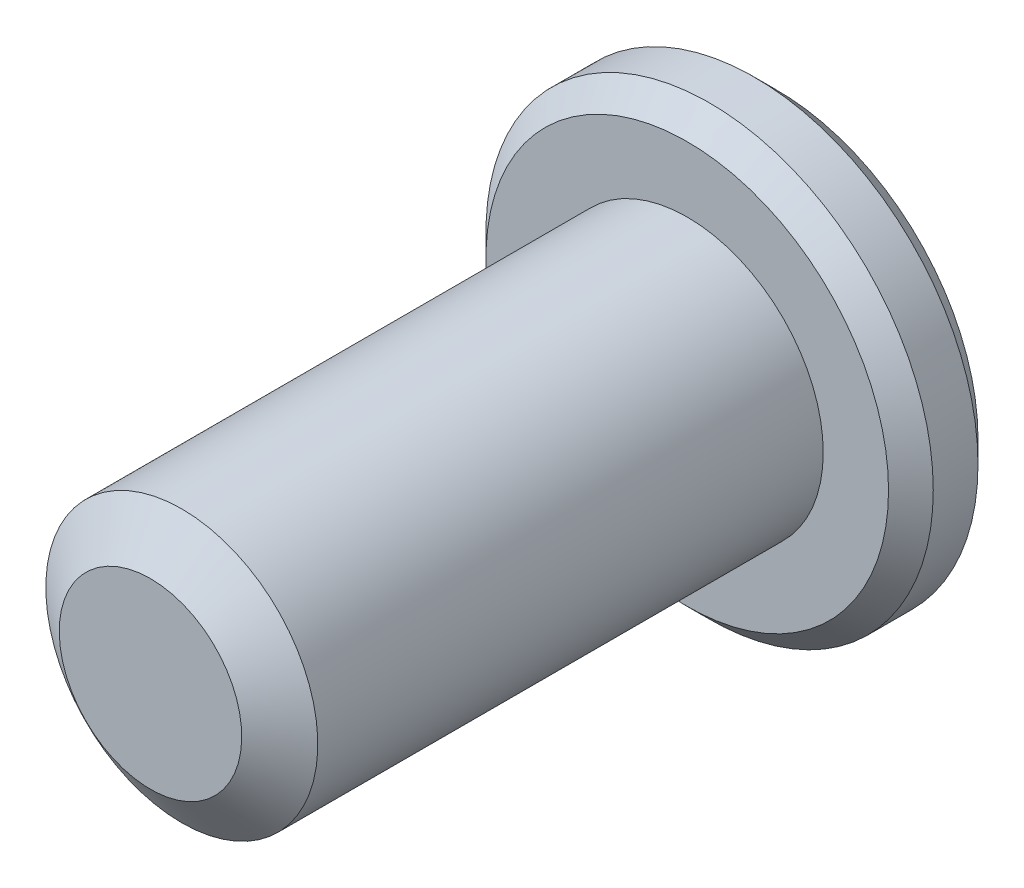
ISO-10303-21;
HEADER;
FILE_DESCRIPTION(('STEP AP214'),'2;1');
FILE_NAME('part.step','',(''),(''),'','','');
FILE_SCHEMA(('AUTOMOTIVE_DESIGN { 1 0 10303 214 1 1 1 1 }'));
ENDSEC;
DATA;
#1=APPLICATION_CONTEXT('core data for automotive mechanical design processes');
#2=APPLICATION_PROTOCOL_DEFINITION('international standard','automotive_design',2000,#1);
#3=PRODUCT_CONTEXT('',#1,'mechanical');
#4=PRODUCT('Part','Part','',(#3));
#5=PRODUCT_RELATED_PRODUCT_CATEGORY('part','',(#4));
#6=PRODUCT_DEFINITION_FORMATION('','',#4);
#7=PRODUCT_DEFINITION_CONTEXT('part definition',#1,'design');
#8=PRODUCT_DEFINITION('design','',#6,#7);
#9=PRODUCT_DEFINITION_SHAPE('','',#8);
#10=(LENGTH_UNIT() NAMED_UNIT(*) SI_UNIT(.MILLI.,.METRE.));
#11=(NAMED_UNIT(*) PLANE_ANGLE_UNIT() SI_UNIT($,.RADIAN.));
#12=(NAMED_UNIT(*) SI_UNIT($,.STERADIAN.) SOLID_ANGLE_UNIT());
#13=UNCERTAINTY_MEASURE_WITH_UNIT(LENGTH_MEASURE(1.E-05),#10,'distance_accuracy_value','');
#14=(GEOMETRIC_REPRESENTATION_CONTEXT(3) GLOBAL_UNCERTAINTY_ASSIGNED_CONTEXT((#13)) GLOBAL_UNIT_ASSIGNED_CONTEXT((#10,
#11,#12)) REPRESENTATION_CONTEXT('',''));
#15=CARTESIAN_POINT('',(0.,0.,0.));
#16=DIRECTION('',(0.,0.,1.));
#17=DIRECTION('',(1.,0.,0.));
#18=AXIS2_PLACEMENT_3D('',#15,#16,#17);
#19=CARTESIAN_POINT('',(0.,0.,0.));
#20=DIRECTION('',(0.,0.,1.));
#21=DIRECTION('',(1.,0.,0.));
#22=AXIS2_PLACEMENT_3D('',#19,#20,#21);
#23=PLANE('',#22);
#24=CARTESIAN_POINT('',(0.,0.,0.));
#25=DIRECTION('',(0.,0.,1.));
#26=DIRECTION('',(1.,0.,0.));
#27=AXIS2_PLACEMENT_3D('',#24,#25,#26);
#28=CIRCLE('',#27,3.571875);
#29=CARTESIAN_POINT('',(3.571875,0.,0.));
#30=VERTEX_POINT('',#29);
#31=EDGE_CURVE('E11',#30,#30,#28,.F.);
#32=ORIENTED_EDGE('',*,*,#31,.T.);
#33=EDGE_LOOP('',(#32));
#34=FACE_BOUND('',#33,.T.);
#35=CARTESIAN_POINT('',(0.,0.,0.));
#36=DIRECTION('',(0.,0.,1.));
#37=DIRECTION('',(1.,0.,0.));
#38=AXIS2_PLACEMENT_3D('',#35,#36,#37);
#39=CIRCLE('',#38,1.3748153285078);
#40=CARTESIAN_POINT('',(1.190625,0.6874076642539,0.));
#41=VERTEX_POINT('',#40);
#42=CARTESIAN_POINT('',(0.,1.3748153285078,0.));
#43=VERTEX_POINT('',#42);
#44=EDGE_CURVE('E92',#41,#43,#39,.T.);
#45=ORIENTED_EDGE('',*,*,#44,.T.);
#46=CARTESIAN_POINT('',(0.,0.,0.));
#47=DIRECTION('',(0.,0.,1.));
#48=DIRECTION('',(1.,0.,0.));
#49=AXIS2_PLACEMENT_3D('',#46,#47,#48);
#50=CIRCLE('',#49,1.3748153285078);
#51=CARTESIAN_POINT('',(-1.190625,0.687407664253897,0.));
#52=VERTEX_POINT('',#51);
#53=EDGE_CURVE('E103',#43,#52,#50,.T.);
#54=ORIENTED_EDGE('',*,*,#53,.T.);
#55=CARTESIAN_POINT('',(0.,0.,0.));
#56=DIRECTION('',(0.,0.,1.));
#57=DIRECTION('',(1.,0.,0.));
#58=AXIS2_PLACEMENT_3D('',#55,#56,#57);
#59=CIRCLE('',#58,1.3748153285078);
#60=CARTESIAN_POINT('',(-1.190625,-0.687407664253897,0.));
#61=VERTEX_POINT('',#60);
#62=EDGE_CURVE('E121',#52,#61,#59,.T.);
#63=ORIENTED_EDGE('',*,*,#62,.T.);
#64=CARTESIAN_POINT('',(0.,0.,0.));
#65=DIRECTION('',(0.,0.,1.));
#66=DIRECTION('',(1.,0.,0.));
#67=AXIS2_PLACEMENT_3D('',#64,#65,#66);
#68=CIRCLE('',#67,1.3748153285078);
#69=CARTESIAN_POINT('',(0.,-1.3748153285078,0.));
#70=VERTEX_POINT('',#69);
#71=EDGE_CURVE('E256',#61,#70,#68,.T.);
#72=ORIENTED_EDGE('',*,*,#71,.T.);
#73=CARTESIAN_POINT('',(0.,0.,0.));
#74=DIRECTION('',(0.,0.,1.));
#75=DIRECTION('',(1.,0.,0.));
#76=AXIS2_PLACEMENT_3D('',#73,#74,#75);
#77=CIRCLE('',#76,1.3748153285078);
#78=CARTESIAN_POINT('',(1.190625,-0.687407664253899,0.));
#79=VERTEX_POINT('',#78);
#80=EDGE_CURVE('E257',#70,#79,#77,.T.);
#81=ORIENTED_EDGE('',*,*,#80,.T.);
#82=CARTESIAN_POINT('',(0.,0.,0.));
#83=DIRECTION('',(0.,0.,1.));
#84=DIRECTION('',(1.,0.,0.));
#85=AXIS2_PLACEMENT_3D('',#82,#83,#84);
#86=CIRCLE('',#85,1.3748153285078);
#87=EDGE_CURVE('E106',#79,#41,#86,.T.);
#88=ORIENTED_EDGE('',*,*,#87,.T.);
#89=EDGE_LOOP('',(#45,#54,#63,#72,#81,#88));
#90=FACE_BOUND('',#89,.T.);
#91=ADVANCED_FACE('F34',(#34,#90),#23,.F.);
#92=CARTESIAN_POINT('',(1.190625,0.687407664253899,1.190625));
#93=DIRECTION('',(-0.499999999999999,-0.866025403784439,0.));
#94=DIRECTION('',(0.866025403784439,-0.5,0.));
#95=AXIS2_PLACEMENT_3D('',#92,#93,#94);
#96=PLANE('',#95);
#97=DIRECTION('',(0.,0.,-1.));
#98=VECTOR('',#97,1.);
#99=CARTESIAN_POINT('',(0.,1.3748153285078,1.190625));
#100=LINE('',#99,#98);
#101=CARTESIAN_POINT('',(0.,1.3748153285078,1.190625));
#102=VERTEX_POINT('',#101);
#103=EDGE_CURVE('E118',#102,#43,#100,.T.);
#104=ORIENTED_EDGE('',*,*,#103,.T.);
#105=CARTESIAN_POINT('',(1.190825,0.687292194200061,-0.000115484600023907));
#106=CARTESIAN_POINT('',(1.14989058041014,0.710925692369386,0.0235012357857367));
#107=CARTESIAN_POINT('',(1.10827161169803,0.734954415158721,0.0457312182768794));
#108=CARTESIAN_POINT('',(1.02340555632637,0.78395185507261,0.0864343373725632));
#109=CARTESIAN_POINT('',(0.980150392709039,0.808925235430916,0.104884817352449));
#110=CARTESIAN_POINT('',(0.892928352542575,0.859282903800292,0.136491161995679));
#111=CARTESIAN_POINT('',(0.848983705042074,0.884654357864149,0.149726495756684));
#112=CARTESIAN_POINT('',(0.760126625836306,0.935956016463003,0.170118548424605));
#113=CARTESIAN_POINT('',(0.715216911165244,0.96188465231757,0.177290497104008));
#114=CARTESIAN_POINT('',(0.637820872343021,1.00656927616579,0.183761461351144));
#115=CARTESIAN_POINT('',(0.605434587484353,1.025267506447,0.18471967985321));
#116=CARTESIAN_POINT('',(0.54071892668223,1.06263111063189,0.183107350927916));
#117=CARTESIAN_POINT('',(0.508389564872727,1.08129647637533,0.180536024820421));
#118=CARTESIAN_POINT('',(0.444042843928515,1.11844707303394,0.172013246006379));
#119=CARTESIAN_POINT('',(0.412025803663232,1.13693211984976,0.166058645247436));
#120=CARTESIAN_POINT('',(0.348526236603542,1.17359361198509,0.1510900359288));
#121=CARTESIAN_POINT('',(0.317043945355835,1.19176992131166,0.142074714087946));
#122=CARTESIAN_POINT('',(0.236410161427873,1.23832385816825,0.115317704161983));
#123=CARTESIAN_POINT('',(0.187767164732341,1.26640790540461,0.0955631855639917));
#124=CARTESIAN_POINT('',(0.0923855836478802,1.32147648691945,0.0510632310423198));
#125=CARTESIAN_POINT('',(0.0456413824128435,1.34846426408555,0.0263340352838411));
#126=CARTESIAN_POINT('',(-0.000200000000001155,1.37493079856163,-0.000115484600024226));
#127=B_SPLINE_CURVE_WITH_KNOTS('',3,(#105,#106,#107,#108,#109,#110,#111,#112,#113,#114,#115,
#116,#117,#118,#119,#120,#121,#122,#123,#124,#125,#126),.UNSPECIFIED.,.F.,.F.,(4,2,2,2,2,2,2,2,
2,2,4),(0.,0.15862567293412,0.318176079843271,0.475191357500655,0.631811068630748,
0.743878551794718,0.855970763007029,0.968167444423241,1.08041232768377,1.25873351645467,
1.43648174479847),.UNSPECIFIED.);
#128=EDGE_CURVE('E89',#41,#43,#127,.T.);
#129=ORIENTED_EDGE('',*,*,#128,.F.);
#130=DIRECTION('',(0.,0.,-1.));
#131=VECTOR('',#130,1.);
#132=CARTESIAN_POINT('',(1.190625,0.687407664253899,1.190625));
#133=LINE('',#132,#131);
#134=CARTESIAN_POINT('',(1.190625,0.687407664253899,1.190625));
#135=VERTEX_POINT('',#134);
#136=EDGE_CURVE('E238',#135,#41,#133,.T.);
#137=ORIENTED_EDGE('',*,*,#136,.F.);
#138=DIRECTION('',(-0.866025403784439,0.499999999999999,0.));
#139=VECTOR('',#138,1.);
#140=CARTESIAN_POINT('',(1.190625,0.687407664253899,1.190625));
#141=LINE('',#140,#139);
#142=EDGE_CURVE('E113',#135,#102,#141,.T.);
#143=ORIENTED_EDGE('',*,*,#142,.T.);
#144=EDGE_LOOP('',(#104,#129,#137,#143));
#145=FACE_BOUND('',#144,.T.);
#146=ADVANCED_FACE('F124',(#145),#96,.T.);
#147=CARTESIAN_POINT('',(1.190625,-0.687407664253897,1.190625));
#148=DIRECTION('',(-1.,0.,0.));
#149=DIRECTION('',(0.,-1.,0.));
#150=AXIS2_PLACEMENT_3D('',#147,#148,#149);
#151=PLANE('',#150);
#152=ORIENTED_EDGE('',*,*,#136,.T.);
#153=CARTESIAN_POINT('',(1.190625,-1.38916643844294,-0.45476694193572));
#154=CARTESIAN_POINT('',(1.190625,-1.35542195687932,-0.429149287592955));
#155=CARTESIAN_POINT('',(1.190625,-1.32149144646904,-0.403777391736522));
#156=CARTESIAN_POINT('',(1.190625,-1.25318216808276,-0.353627135242609));
#157=CARTESIAN_POINT('',(1.190625,-1.21880329157501,-0.328848922590785));
#158=CARTESIAN_POINT('',(1.190625,-1.11437661211185,-0.255204206371073));
#159=CARTESIAN_POINT('',(1.190625,-1.04355144779088,-0.207421844233936));
#160=CARTESIAN_POINT('',(1.190625,-0.894915294948761,-0.113451072200958));
#161=CARTESIAN_POINT('',(1.190625,-0.816938492992397,-0.0675220158899768));
#162=CARTESIAN_POINT('',(1.190625,-0.657067181308588,0.0166091161734408));
#163=CARTESIAN_POINT('',(1.190625,-0.575187091346148,0.0548372626788523));
#164=CARTESIAN_POINT('',(1.190625,-0.452457493498404,0.101611220082772));
#165=CARTESIAN_POINT('',(1.190625,-0.413463701609668,0.115004723016236));
#166=CARTESIAN_POINT('',(1.190625,-0.334518826921276,0.138663309235378));
#167=CARTESIAN_POINT('',(1.190625,-0.294567679897538,0.14892818199989));
#168=CARTESIAN_POINT('',(1.190625,-0.214623188802744,0.165620073914436));
#169=CARTESIAN_POINT('',(1.190625,-0.174644032488745,0.172113971687998));
#170=CARTESIAN_POINT('',(1.190625,-0.0942380730837807,0.181134172350742));
#171=CARTESIAN_POINT('',(1.190625,-0.0538113526379938,0.183661195833294));
#172=CARTESIAN_POINT('',(1.190625,0.0255383407816151,0.184552116530744));
#173=CARTESIAN_POINT('',(1.190625,0.0644596113520864,0.183071740608997));
#174=CARTESIAN_POINT('',(1.190625,0.141981059247864,0.176377058775293));
#175=CARTESIAN_POINT('',(1.190625,0.180581174701403,0.171162049484535));
#176=CARTESIAN_POINT('',(1.190625,0.257829165397498,0.157197311775403));
#177=CARTESIAN_POINT('',(1.190625,0.296465909233881,0.148386948843526));
#178=CARTESIAN_POINT('',(1.190625,0.372892795970691,0.127705222963376));
#179=CARTESIAN_POINT('',(1.190625,0.410683003088108,0.115834093060724));
#180=CARTESIAN_POINT('',(1.190625,0.528843619765776,0.0742282460545102));
#181=CARTESIAN_POINT('',(1.190625,0.607553287318553,0.0397892607525505));
#182=CARTESIAN_POINT('',(1.190625,0.76128213752637,-0.0368041658068966));
#183=CARTESIAN_POINT('',(1.190625,0.836286885497864,-0.0789861622516232));
#184=CARTESIAN_POINT('',(1.190625,0.979643165030946,-0.166035696054511));
#185=CARTESIAN_POINT('',(1.190625,1.04814020943389,-0.210666580265316));
#186=CARTESIAN_POINT('',(1.190625,1.14905648590012,-0.279671790514186));
#187=CARTESIAN_POINT('',(1.190625,1.18226013275334,-0.302918870239015));
#188=CARTESIAN_POINT('',(1.190625,1.2482131327985,-0.35003064884318));
#189=CARTESIAN_POINT('',(1.190625,1.28096260769197,-0.373895177157337));
#190=CARTESIAN_POINT('',(1.190625,1.31352286649707,-0.398015800346744));
#191=B_SPLINE_CURVE_WITH_KNOTS('',3,(#153,#154,#155,#156,#157,#158,#159,#160,#161,#162,#163,
#164,#165,#166,#167,#168,#169,#170,#171,#172,#173,#174,#175,#176,#177,#178,#179,#180,#181,#182,
#183,#184,#185,#186,#187,#188,#189,#190),.UNSPECIFIED.,.F.,.F.,(4,2,2,2,2,2,2,2,2,2,2,2,2,2,2,2,
2,2,4),(0.,0.12709752391975,0.254226406229842,0.510423216744709,0.781699472750919,
1.05204131412725,1.17562672435423,1.29922044863633,1.42054942652937,1.54185636213618,
1.65851767015942,1.77520095588991,1.89393922046999,2.01266844703265,2.26965678658552,
2.52757805856858,2.7727186083136,2.89431235585272,3.01587286536344),.UNSPECIFIED.);
#192=EDGE_CURVE('E96',#79,#41,#191,.T.);
#193=ORIENTED_EDGE('',*,*,#192,.F.);
#194=DIRECTION('',(0.,0.,-1.));
#195=VECTOR('',#194,1.);
#196=CARTESIAN_POINT('',(1.190625,-0.687407664253897,1.190625));
#197=LINE('',#196,#195);
#198=CARTESIAN_POINT('',(1.190625,-0.687407664253897,1.190625));
#199=VERTEX_POINT('',#198);
#200=EDGE_CURVE('E240',#199,#79,#197,.T.);
#201=ORIENTED_EDGE('',*,*,#200,.F.);
#202=DIRECTION('',(0.,1.,0.));
#203=VECTOR('',#202,1.);
#204=CARTESIAN_POINT('',(1.190625,-0.687407664253897,1.190625));
#205=LINE('',#204,#203);
#206=EDGE_CURVE('E49',#199,#135,#205,.T.);
#207=ORIENTED_EDGE('',*,*,#206,.T.);
#208=EDGE_LOOP('',(#152,#193,#201,#207));
#209=FACE_BOUND('',#208,.T.);
#210=ADVANCED_FACE('F185',(#209),#151,.T.);
#211=CARTESIAN_POINT('',(0.,-1.3748153285078,1.190625));
#212=DIRECTION('',(-0.5,0.866025403784439,0.));
#213=DIRECTION('',(-0.866025403784438,-0.5,0.));
#214=AXIS2_PLACEMENT_3D('',#211,#212,#213);
#215=PLANE('',#214);
#216=ORIENTED_EDGE('',*,*,#200,.T.);
#217=CARTESIAN_POINT('',(-0.000199999999999452,-1.37493079856163,-0.000115484600023343));
#218=CARTESIAN_POINT('',(0.0407344195898569,-1.35129730039231,0.0235012357857374));
#219=CARTESIAN_POINT('',(0.0823533883019743,-1.32726857760297,0.0457312182768799));
#220=CARTESIAN_POINT('',(0.167219443673633,-1.27827113768908,0.0864343373725635));
#221=CARTESIAN_POINT('',(0.210474607290961,-1.25329775733078,0.104884817352449));
#222=CARTESIAN_POINT('',(0.297696647457424,-1.2029400889614,0.136491161995679));
#223=CARTESIAN_POINT('',(0.341641294957925,-1.17756863489755,0.149726495756684));
#224=CARTESIAN_POINT('',(0.430498374163694,-1.12626697629869,0.170118548424606));
#225=CARTESIAN_POINT('',(0.475408088834755,-1.10033834044412,0.177290497104008));
#226=CARTESIAN_POINT('',(0.552804127656978,-1.0556537165959,0.183761461351144));
#227=CARTESIAN_POINT('',(0.585190412515646,-1.0369554863147,0.184719679853211));
#228=CARTESIAN_POINT('',(0.64990607331777,-0.999591882129809,0.183107350927917));
#229=CARTESIAN_POINT('',(0.682235435127272,-0.980926516386364,0.180536024820421));
#230=CARTESIAN_POINT('',(0.746582156071484,-0.943775919727753,0.172013246006379));
#231=CARTESIAN_POINT('',(0.778599196336768,-0.925290872911937,0.166058645247436));
#232=CARTESIAN_POINT('',(0.842098763396457,-0.8886293807766,0.1510900359288));
#233=CARTESIAN_POINT('',(0.873581054644164,-0.870453071450031,0.142074714087946));
#234=CARTESIAN_POINT('',(0.954214838572126,-0.823899134593443,0.115317704161984));
#235=CARTESIAN_POINT('',(1.00285783526766,-0.795815087357088,0.0955631855639923));
#236=CARTESIAN_POINT('',(1.09823941635212,-0.740746505842242,0.0510632310423203));
#237=CARTESIAN_POINT('',(1.14498361758716,-0.71375872867614,0.0263340352838416));
#238=CARTESIAN_POINT('',(1.190825,-0.687292194200059,-0.000115484600023708));
#239=B_SPLINE_CURVE_WITH_KNOTS('',3,(#217,#218,#219,#220,#221,#222,#223,#224,#225,#226,#227,
#228,#229,#230,#231,#232,#233,#234,#235,#236,#237,#238),.UNSPECIFIED.,.F.,.F.,(4,2,2,2,2,2,2,2,
2,2,4),(0.,0.15862567293412,0.31817607984327,0.475191357500655,0.631811068630748,
0.743878551794717,0.855970763007028,0.968167444423241,1.08041232768376,1.25873351645467,
1.43648174479847),.UNSPECIFIED.);
#240=EDGE_CURVE('E294',#70,#79,#239,.T.);
#241=ORIENTED_EDGE('',*,*,#240,.F.);
#242=DIRECTION('',(0.,0.,-1.));
#243=VECTOR('',#242,1.);
#244=CARTESIAN_POINT('',(0.,-1.3748153285078,1.190625));
#245=LINE('',#244,#243);
#246=CARTESIAN_POINT('',(0.,-1.3748153285078,1.190625));
#247=VERTEX_POINT('',#246);
#248=EDGE_CURVE('E242',#247,#70,#245,.T.);
#249=ORIENTED_EDGE('',*,*,#248,.F.);
#250=DIRECTION('',(0.866025403784438,0.5,0.));
#251=VECTOR('',#250,1.);
#252=CARTESIAN_POINT('',(0.,-1.3748153285078,1.190625));
#253=LINE('',#252,#251);
#254=EDGE_CURVE('E57',#247,#199,#253,.T.);
#255=ORIENTED_EDGE('',*,*,#254,.T.);
#256=EDGE_LOOP('',(#216,#241,#249,#255));
#257=FACE_BOUND('',#256,.T.);
#258=ADVANCED_FACE('F210',(#257),#215,.T.);
#259=CARTESIAN_POINT('',(-1.190625,-0.687407664253898,1.190625));
#260=DIRECTION('',(0.5,0.866025403784439,0.));
#261=DIRECTION('',(-0.866025403784439,0.5,0.));
#262=AXIS2_PLACEMENT_3D('',#259,#260,#261);
#263=PLANE('',#262);
#264=ORIENTED_EDGE('',*,*,#248,.T.);
#265=CARTESIAN_POINT('',(-1.190825,-0.68729219420006,-0.000115484600024124));
#266=CARTESIAN_POINT('',(-1.14989058041014,-0.710925692369384,0.0235012357857365));
#267=CARTESIAN_POINT('',(-1.10827161169803,-0.73495441515872,0.0457312182768791));
#268=CARTESIAN_POINT('',(-1.02340555632637,-0.783951855072609,0.086434337372563));
#269=CARTESIAN_POINT('',(-0.980150392709039,-0.808925235430915,0.104884817352449));
#270=CARTESIAN_POINT('',(-0.892928352542576,-0.859282903800291,0.136491161995679));
#271=CARTESIAN_POINT('',(-0.848983705042075,-0.884654357864148,0.149726495756684));
#272=CARTESIAN_POINT('',(-0.760126625836306,-0.935956016463003,0.170118548424606));
#273=CARTESIAN_POINT('',(-0.715216911165245,-0.961884652317569,0.177290497104008));
#274=CARTESIAN_POINT('',(-0.637820872343022,-1.00656927616579,0.183761461351144));
#275=CARTESIAN_POINT('',(-0.605434587484353,-1.02526750644699,0.184719679853211));
#276=CARTESIAN_POINT('',(-0.54071892668223,-1.06263111063188,0.183107350927917));
#277=CARTESIAN_POINT('',(-0.508389564872727,-1.08129647637533,0.180536024820421));
#278=CARTESIAN_POINT('',(-0.444042843928515,-1.11844707303394,0.172013246006379));
#279=CARTESIAN_POINT('',(-0.412025803663232,-1.13693211984976,0.166058645247437));
#280=CARTESIAN_POINT('',(-0.348526236603543,-1.17359361198509,0.151090035928801));
#281=CARTESIAN_POINT('',(-0.317043945355835,-1.19176992131166,0.142074714087946));
#282=CARTESIAN_POINT('',(-0.236410161427873,-1.23832385816825,0.115317704161984));
#283=CARTESIAN_POINT('',(-0.187767164732342,-1.26640790540461,0.0955631855639923));
#284=CARTESIAN_POINT('',(-0.0923855836478807,-1.32147648691945,0.0510632310423207));
#285=CARTESIAN_POINT('',(-0.045641382412844,-1.34846426408555,0.0263340352838421));
#286=CARTESIAN_POINT('',(0.000200000000000449,-1.37493079856163,-0.000115484600023493));
#287=B_SPLINE_CURVE_WITH_KNOTS('',3,(#265,#266,#267,#268,#269,#270,#271,#272,#273,#274,#275,
#276,#277,#278,#279,#280,#281,#282,#283,#284,#285,#286),.UNSPECIFIED.,.F.,.F.,(4,2,2,2,2,2,2,2,
2,2,4),(0.,0.158625672934121,0.318176079843272,0.475191357500656,0.63181106863075,
0.743878551794719,0.85597076300703,0.968167444423243,1.08041232768377,1.25873351645467,
1.43648174479847),.UNSPECIFIED.);
#288=EDGE_CURVE('E253',#61,#70,#287,.T.);
#289=ORIENTED_EDGE('',*,*,#288,.F.);
#290=DIRECTION('',(0.,0.,-1.));
#291=VECTOR('',#290,1.);
#292=CARTESIAN_POINT('',(-1.190625,-0.687407664253898,1.190625));
#293=LINE('',#292,#291);
#294=CARTESIAN_POINT('',(-1.190625,-0.687407664253898,1.190625));
#295=VERTEX_POINT('',#294);
#296=EDGE_CURVE('E131',#295,#61,#293,.T.);
#297=ORIENTED_EDGE('',*,*,#296,.F.);
#298=DIRECTION('',(0.866025403784439,-0.5,0.));
#299=VECTOR('',#298,1.);
#300=CARTESIAN_POINT('',(-1.190625,-0.687407664253898,1.190625));
#301=LINE('',#300,#299);
#302=EDGE_CURVE('E234',#295,#247,#301,.T.);
#303=ORIENTED_EDGE('',*,*,#302,.T.);
#304=EDGE_LOOP('',(#264,#289,#297,#303));
#305=FACE_BOUND('',#304,.T.);
#306=ADVANCED_FACE('F206',(#305),#263,.T.);
#307=CARTESIAN_POINT('',(-1.190625,0.687407664253898,1.190625));
#308=DIRECTION('',(1.,0.,0.));
#309=DIRECTION('',(0.,1.,0.));
#310=AXIS2_PLACEMENT_3D('',#307,#308,#309);
#311=PLANE('',#310);
#312=ORIENTED_EDGE('',*,*,#296,.T.);
#313=CARTESIAN_POINT('',(-1.190625,-1.38916643844294,-0.454766941935719));
#314=CARTESIAN_POINT('',(-1.190625,-1.35542195687932,-0.429149287592954));
#315=CARTESIAN_POINT('',(-1.190625,-1.32149144646903,-0.403777391736521));
#316=CARTESIAN_POINT('',(-1.190625,-1.25318216808275,-0.353627135242608));
#317=CARTESIAN_POINT('',(-1.190625,-1.21880329157501,-0.328848922590784));
#318=CARTESIAN_POINT('',(-1.190625,-1.11437661211185,-0.255204206371073));
#319=CARTESIAN_POINT('',(-1.190625,-1.04355144779087,-0.207421844233936));
#320=CARTESIAN_POINT('',(-1.190625,-0.89491529494876,-0.113451072200958));
#321=CARTESIAN_POINT('',(-1.190625,-0.816938492992396,-0.0675220158899768));
#322=CARTESIAN_POINT('',(-1.190625,-0.657067181308589,0.0166091161734404));
#323=CARTESIAN_POINT('',(-1.190625,-0.575187091346149,0.0548372626788516));
#324=CARTESIAN_POINT('',(-1.190625,-0.452457493498405,0.101611220082771));
#325=CARTESIAN_POINT('',(-1.190625,-0.413463701609668,0.115004723016235));
#326=CARTESIAN_POINT('',(-1.190625,-0.334518826921276,0.138663309235377));
#327=CARTESIAN_POINT('',(-1.190625,-0.294567679897539,0.148928181999889));
#328=CARTESIAN_POINT('',(-1.190625,-0.214623188802744,0.165620073914435));
#329=CARTESIAN_POINT('',(-1.190625,-0.174644032488745,0.172113971687998));
#330=CARTESIAN_POINT('',(-1.190625,-0.0942380730837811,0.181134172350741));
#331=CARTESIAN_POINT('',(-1.190625,-0.0538113526379941,0.183661195833293));
#332=CARTESIAN_POINT('',(-1.190625,0.0255383407816149,0.184552116530743));
#333=CARTESIAN_POINT('',(-1.190625,0.0644596113520861,0.183071740608996));
#334=CARTESIAN_POINT('',(-1.190625,0.141981059247864,0.176377058775292));
#335=CARTESIAN_POINT('',(-1.190625,0.180581174701402,0.171162049484534));
#336=CARTESIAN_POINT('',(-1.190625,0.257829165397498,0.157197311775401));
#337=CARTESIAN_POINT('',(-1.190625,0.29646590923388,0.148386948843524));
#338=CARTESIAN_POINT('',(-1.190625,0.372892795970691,0.127705222963375));
#339=CARTESIAN_POINT('',(-1.190625,0.410683003088108,0.115834093060722));
#340=CARTESIAN_POINT('',(-1.190625,0.528843619765776,0.0742282460545088));
#341=CARTESIAN_POINT('',(-1.190625,0.607553287318553,0.0397892607525491));
#342=CARTESIAN_POINT('',(-1.190625,0.761282137526371,-0.0368041658068982));
#343=CARTESIAN_POINT('',(-1.190625,0.836286885497864,-0.0789861622516246));
#344=CARTESIAN_POINT('',(-1.190625,0.979643165030946,-0.166035696054513));
#345=CARTESIAN_POINT('',(-1.190625,1.04814020943389,-0.210666580265318));
#346=CARTESIAN_POINT('',(-1.190625,1.14905648590012,-0.279671790514188));
#347=CARTESIAN_POINT('',(-1.190625,1.18226013275334,-0.302918870239017));
#348=CARTESIAN_POINT('',(-1.190625,1.2482131327985,-0.350030648843182));
#349=CARTESIAN_POINT('',(-1.190625,1.28096260769197,-0.373895177157339));
#350=CARTESIAN_POINT('',(-1.190625,1.31352286649707,-0.398015800346746));
#351=B_SPLINE_CURVE_WITH_KNOTS('',3,(#313,#314,#315,#316,#317,#318,#319,#320,#321,#322,#323,
#324,#325,#326,#327,#328,#329,#330,#331,#332,#333,#334,#335,#336,#337,#338,#339,#340,#341,#342,
#343,#344,#345,#346,#347,#348,#349,#350),.UNSPECIFIED.,.F.,.F.,(4,2,2,2,2,2,2,2,2,2,2,2,2,2,2,2,
2,2,4),(0.,0.12709752391975,0.254226406229842,0.510423216744708,0.781699472750918,
1.05204131412725,1.17562672435423,1.29922044863632,1.42054942652936,1.54185636213618,
1.65851767015941,1.77520095588991,1.89393922046999,2.01266844703265,2.26965678658552,
2.52757805856858,2.7727186083136,2.89431235585272,3.01587286536344),.UNSPECIFIED.);
#352=EDGE_CURVE('E248',#52,#61,#351,.F.);
#353=ORIENTED_EDGE('',*,*,#352,.F.);
#354=DIRECTION('',(0.,0.,-1.));
#355=VECTOR('',#354,1.);
#356=CARTESIAN_POINT('',(-1.190625,0.687407664253898,1.190625));
#357=LINE('',#356,#355);
#358=CARTESIAN_POINT('',(-1.190625,0.687407664253898,1.190625));
#359=VERTEX_POINT('',#358);
#360=EDGE_CURVE('E120',#359,#52,#357,.T.);
#361=ORIENTED_EDGE('',*,*,#360,.F.);
#362=DIRECTION('',(0.,-1.,0.));
#363=VECTOR('',#362,1.);
#364=CARTESIAN_POINT('',(-1.190625,0.687407664253898,1.190625));
#365=LINE('',#364,#363);
#366=EDGE_CURVE('E232',#359,#295,#365,.T.);
#367=ORIENTED_EDGE('',*,*,#366,.T.);
#368=EDGE_LOOP('',(#312,#353,#361,#367));
#369=FACE_BOUND('',#368,.T.);
#370=ADVANCED_FACE('F203',(#369),#311,.T.);
#371=CARTESIAN_POINT('',(0.,1.3748153285078,1.190625));
#372=DIRECTION('',(0.5,-0.866025403784438,0.));
#373=DIRECTION('',(0.866025403784438,0.5,0.));
#374=AXIS2_PLACEMENT_3D('',#371,#372,#373);
#375=PLANE('',#374);
#376=ORIENTED_EDGE('',*,*,#360,.T.);
#377=CARTESIAN_POINT('',(0.000199999999998667,1.37493079856163,-0.000115484600024211));
#378=CARTESIAN_POINT('',(-0.0407344195898576,1.35129730039231,0.0235012357857364));
#379=CARTESIAN_POINT('',(-0.082353388301975,1.32726857760297,0.045731218276879));
#380=CARTESIAN_POINT('',(-0.167219443673633,1.27827113768909,0.0864343373725626));
#381=CARTESIAN_POINT('',(-0.210474607290962,1.25329775733078,0.104884817352448));
#382=CARTESIAN_POINT('',(-0.297696647457425,1.2029400889614,0.136491161995679));
#383=CARTESIAN_POINT('',(-0.341641294957926,1.17756863489755,0.149726495756683));
#384=CARTESIAN_POINT('',(-0.430498374163694,1.12626697629869,0.170118548424605));
#385=CARTESIAN_POINT('',(-0.475408088834755,1.10033834044413,0.177290497104007));
#386=CARTESIAN_POINT('',(-0.552804127656979,1.0556537165959,0.183761461351143));
#387=CARTESIAN_POINT('',(-0.585190412515647,1.0369554863147,0.18471967985321));
#388=CARTESIAN_POINT('',(-0.64990607331777,0.99959188212981,0.183107350927916));
#389=CARTESIAN_POINT('',(-0.682235435127273,0.980926516386364,0.18053602482042));
#390=CARTESIAN_POINT('',(-0.746582156071485,0.943775919727754,0.172013246006378));
#391=CARTESIAN_POINT('',(-0.778599196336768,0.925290872911937,0.166058645247436));
#392=CARTESIAN_POINT('',(-0.842098763396458,0.888629380776601,0.1510900359288));
#393=CARTESIAN_POINT('',(-0.873581054644165,0.870453071450031,0.142074714087945));
#394=CARTESIAN_POINT('',(-0.954214838572127,0.823899134593444,0.115317704161983));
#395=CARTESIAN_POINT('',(-1.00285783526766,0.795815087357089,0.0955631855639912));
#396=CARTESIAN_POINT('',(-1.09823941635212,0.740746505842243,0.0510632310423194));
#397=CARTESIAN_POINT('',(-1.14498361758716,0.71375872867614,0.0263340352838408));
#398=CARTESIAN_POINT('',(-1.190825,0.68729219420006,-0.00011548460002466));
#399=B_SPLINE_CURVE_WITH_KNOTS('',3,(#377,#378,#379,#380,#381,#382,#383,#384,#385,#386,#387,
#388,#389,#390,#391,#392,#393,#394,#395,#396,#397,#398),.UNSPECIFIED.,.F.,.F.,(4,2,2,2,2,2,2,2,
2,2,4),(0.,0.15862567293412,0.318176079843271,0.475191357500655,0.631811068630748,
0.743878551794717,0.855970763007028,0.968167444423241,1.08041232768377,1.25873351645467,
1.43648174479847),.UNSPECIFIED.);
#400=EDGE_CURVE('E112',#43,#52,#399,.T.);
#401=ORIENTED_EDGE('',*,*,#400,.F.);
#402=ORIENTED_EDGE('',*,*,#103,.F.);
#403=DIRECTION('',(-0.866025403784438,-0.5,0.));
#404=VECTOR('',#403,1.);
#405=CARTESIAN_POINT('',(0.,1.3748153285078,1.190625));
#406=LINE('',#405,#404);
#407=EDGE_CURVE('E230',#102,#359,#406,.T.);
#408=ORIENTED_EDGE('',*,*,#407,.T.);
#409=EDGE_LOOP('',(#376,#401,#402,#408));
#410=FACE_BOUND('',#409,.T.);
#411=ADVANCED_FACE('F117',(#410),#375,.T.);
#412=CARTESIAN_POINT('',(0.,0.,11.1125));
#413=DIRECTION('',(0.,0.,-1.));
#414=DIRECTION('',(-1.,0.,0.));
#415=AXIS2_PLACEMENT_3D('',#412,#413,#414);
#416=CYLINDRICAL_SURFACE('',#415,2.413);
#417=CARTESIAN_POINT('',(0.,0.,1.5875));
#418=DIRECTION('',(0.,0.,1.));
#419=DIRECTION('',(1.,0.,0.));
#420=AXIS2_PLACEMENT_3D('',#417,#418,#419);
#421=CIRCLE('',#420,2.413);
#422=CARTESIAN_POINT('',(2.413,0.,1.5875));
#423=VERTEX_POINT('',#422);
#424=EDGE_CURVE('E126',#423,#423,#421,.T.);
#425=ORIENTED_EDGE('',*,*,#424,.T.);
#426=EDGE_LOOP('',(#425));
#427=FACE_BOUND('',#426,.T.);
#428=CARTESIAN_POINT('',(0.,0.,10.5567102665461));
#429=DIRECTION('',(0.,0.,-1.));
#430=DIRECTION('',(0.,1.,0.));
#431=AXIS2_PLACEMENT_3D('',#428,#429,#430);
#432=CIRCLE('',#431,2.413);
#433=CARTESIAN_POINT('',(0.,2.413,10.5567102665461));
#434=VERTEX_POINT('',#433);
#435=EDGE_CURVE('E137',#434,#434,#432,.T.);
#436=ORIENTED_EDGE('',*,*,#435,.T.);
#437=EDGE_LOOP('',(#436));
#438=FACE_BOUND('',#437,.T.);
#439=ADVANCED_FACE('F163',(#427,#438),#416,.T.);
#440=CARTESIAN_POINT('',(0.,0.,11.1125));
#441=DIRECTION('',(0.,0.,-1.));
#442=DIRECTION('',(0.,1.,0.));
#443=AXIS2_PLACEMENT_3D('',#440,#441,#442);
#444=CONICAL_SURFACE('',#443,1.61925,0.959931088596886);
#445=ORIENTED_EDGE('',*,*,#435,.F.);
#446=EDGE_LOOP('',(#445));
#447=FACE_BOUND('',#446,.T.);
#448=CARTESIAN_POINT('',(0.,0.,11.1125));
#449=DIRECTION('',(0.,0.,-1.));
#450=DIRECTION('',(0.,1.,0.));
#451=AXIS2_PLACEMENT_3D('',#448,#449,#450);
#452=CIRCLE('',#451,1.61925);
#453=CARTESIAN_POINT('',(0.,1.61925,11.1125));
#454=VERTEX_POINT('',#453);
#455=EDGE_CURVE('E129',#454,#454,#452,.T.);
#456=ORIENTED_EDGE('',*,*,#455,.T.);
#457=EDGE_LOOP('',(#456));
#458=FACE_BOUND('',#457,.T.);
#459=ADVANCED_FACE('F166',(#447,#458),#444,.T.);
#460=CARTESIAN_POINT('',(0.,0.,11.1125));
#461=DIRECTION('',(0.,0.,1.));
#462=DIRECTION('',(1.,0.,0.));
#463=AXIS2_PLACEMENT_3D('',#460,#461,#462);
#464=PLANE('',#463);
#465=ORIENTED_EDGE('',*,*,#455,.F.);
#466=EDGE_LOOP('',(#465));
#467=FACE_BOUND('',#466,.T.);
#468=ADVANCED_FACE('F159',(#467),#464,.T.);
#469=CARTESIAN_POINT('',(0.,0.,1.5875));
#470=DIRECTION('',(0.,0.,1.));
#471=DIRECTION('',(1.,0.,0.));
#472=AXIS2_PLACEMENT_3D('',#469,#470,#471);
#473=PLANE('',#472);
#474=CARTESIAN_POINT('',(0.,0.,1.5875));
#475=DIRECTION('',(0.,0.,1.));
#476=DIRECTION('',(1.,0.,0.));
#477=AXIS2_PLACEMENT_3D('',#474,#475,#476);
#478=CIRCLE('',#477,3.571875);
#479=CARTESIAN_POINT('',(3.571875,0.,1.5875));
#480=VERTEX_POINT('',#479);
#481=EDGE_CURVE('E139',#480,#480,#478,.T.);
#482=ORIENTED_EDGE('',*,*,#481,.T.);
#483=EDGE_LOOP('',(#482));
#484=FACE_BOUND('',#483,.T.);
#485=ORIENTED_EDGE('',*,*,#424,.F.);
#486=EDGE_LOOP('',(#485));
#487=FACE_BOUND('',#486,.T.);
#488=ADVANCED_FACE('F156',(#484,#487),#473,.T.);
#489=CARTESIAN_POINT('',(0.,0.,1.5875));
#490=DIRECTION('',(0.,0.,-1.));
#491=DIRECTION('',(-1.,0.,0.));
#492=AXIS2_PLACEMENT_3D('',#489,#490,#491);
#493=CYLINDRICAL_SURFACE('',#492,3.96875);
#494=CARTESIAN_POINT('',(0.,0.,1.190625));
#495=DIRECTION('',(0.,0.,1.));
#496=DIRECTION('',(1.,0.,0.));
#497=AXIS2_PLACEMENT_3D('',#494,#495,#496);
#498=CIRCLE('',#497,3.96875);
#499=CARTESIAN_POINT('',(3.96875,0.,1.190625));
#500=VERTEX_POINT('',#499);
#501=EDGE_CURVE('E42',#500,#500,#498,.F.);
#502=ORIENTED_EDGE('',*,*,#501,.T.);
#503=EDGE_LOOP('',(#502));
#504=FACE_BOUND('',#503,.T.);
#505=CARTESIAN_POINT('',(0.,0.,0.396875000000001));
#506=DIRECTION('',(0.,0.,1.));
#507=DIRECTION('',(1.,0.,0.));
#508=AXIS2_PLACEMENT_3D('',#505,#506,#507);
#509=CIRCLE('',#508,3.96875);
#510=CARTESIAN_POINT('',(3.96875,0.,0.396875000000001));
#511=VERTEX_POINT('',#510);
#512=EDGE_CURVE('E143',#511,#511,#509,.T.);
#513=ORIENTED_EDGE('',*,*,#512,.T.);
#514=EDGE_LOOP('',(#513));
#515=FACE_BOUND('',#514,.T.);
#516=ADVANCED_FACE('F148',(#504,#515),#493,.T.);
#517=CARTESIAN_POINT('',(-1.190625,2.06222299276169,1.190625));
#518=DIRECTION('',(0.,0.,1.));
#519=DIRECTION('',(1.,0.,0.));
#520=AXIS2_PLACEMENT_3D('',#517,#518,#519);
#521=PLANE('',#520);
#522=ORIENTED_EDGE('',*,*,#142,.F.);
#523=ORIENTED_EDGE('',*,*,#206,.F.);
#524=ORIENTED_EDGE('',*,*,#254,.F.);
#525=ORIENTED_EDGE('',*,*,#302,.F.);
#526=ORIENTED_EDGE('',*,*,#366,.F.);
#527=ORIENTED_EDGE('',*,*,#407,.F.);
#528=EDGE_LOOP('',(#522,#523,#524,#525,#526,#527));
#529=FACE_BOUND('',#528,.T.);
#530=ADVANCED_FACE('F193',(#529),#521,.F.);
#531=CARTESIAN_POINT('',(0.,0.,0.));
#532=DIRECTION('',(0.,0.,-1.));
#533=DIRECTION('',(1.,0.,0.));
#534=AXIS2_PLACEMENT_3D('',#531,#532,#533);
#535=CONICAL_SURFACE('',#534,1.3748153285078,0.78539816339745);
#536=ORIENTED_EDGE('',*,*,#400,.T.);
#537=ORIENTED_EDGE('',*,*,#53,.F.);
#538=EDGE_LOOP('',(#536,#537));
#539=FACE_BOUND('',#538,.T.);
#540=ADVANCED_FACE('F111',(#539),#535,.F.);
#541=CARTESIAN_POINT('',(0.,0.,0.));
#542=DIRECTION('',(0.,0.,-1.));
#543=DIRECTION('',(1.,0.,0.));
#544=AXIS2_PLACEMENT_3D('',#541,#542,#543);
#545=CONICAL_SURFACE('',#544,1.3748153285078,0.78539816339745);
#546=ORIENTED_EDGE('',*,*,#352,.T.);
#547=ORIENTED_EDGE('',*,*,#62,.F.);
#548=EDGE_LOOP('',(#546,#547));
#549=FACE_BOUND('',#548,.T.);
#550=ADVANCED_FACE('F219',(#549),#545,.F.);
#551=CARTESIAN_POINT('',(0.,0.,0.));
#552=DIRECTION('',(0.,0.,-1.));
#553=DIRECTION('',(1.,0.,0.));
#554=AXIS2_PLACEMENT_3D('',#551,#552,#553);
#555=CONICAL_SURFACE('',#554,1.3748153285078,0.78539816339745);
#556=ORIENTED_EDGE('',*,*,#288,.T.);
#557=ORIENTED_EDGE('',*,*,#71,.F.);
#558=EDGE_LOOP('',(#556,#557));
#559=FACE_BOUND('',#558,.T.);
#560=ADVANCED_FACE('F276',(#559),#555,.F.);
#561=CARTESIAN_POINT('',(0.,0.,0.));
#562=DIRECTION('',(0.,0.,-1.));
#563=DIRECTION('',(1.,0.,0.));
#564=AXIS2_PLACEMENT_3D('',#561,#562,#563);
#565=CONICAL_SURFACE('',#564,1.3748153285078,0.78539816339745);
#566=ORIENTED_EDGE('',*,*,#240,.T.);
#567=ORIENTED_EDGE('',*,*,#80,.F.);
#568=EDGE_LOOP('',(#566,#567));
#569=FACE_BOUND('',#568,.T.);
#570=ADVANCED_FACE('F280',(#569),#565,.F.);
#571=CARTESIAN_POINT('',(0.,0.,0.));
#572=DIRECTION('',(0.,0.,-1.));
#573=DIRECTION('',(1.,0.,0.));
#574=AXIS2_PLACEMENT_3D('',#571,#572,#573);
#575=CONICAL_SURFACE('',#574,1.3748153285078,0.78539816339745);
#576=ORIENTED_EDGE('',*,*,#192,.T.);
#577=ORIENTED_EDGE('',*,*,#87,.F.);
#578=EDGE_LOOP('',(#576,#577));
#579=FACE_BOUND('',#578,.T.);
#580=ADVANCED_FACE('F284',(#579),#575,.F.);
#581=CARTESIAN_POINT('',(0.,0.,0.));
#582=DIRECTION('',(0.,0.,-1.));
#583=DIRECTION('',(1.,0.,0.));
#584=AXIS2_PLACEMENT_3D('',#581,#582,#583);
#585=CONICAL_SURFACE('',#584,1.3748153285078,0.78539816339745);
#586=ORIENTED_EDGE('',*,*,#128,.T.);
#587=ORIENTED_EDGE('',*,*,#44,.F.);
#588=EDGE_LOOP('',(#586,#587));
#589=FACE_BOUND('',#588,.T.);
#590=ADVANCED_FACE('F91',(#589),#585,.F.);
#591=CARTESIAN_POINT('',(0.,0.,1.5875));
#592=DIRECTION('',(0.,0.,-1.));
#593=DIRECTION('',(-1.,0.,0.));
#594=AXIS2_PLACEMENT_3D('',#591,#592,#593);
#595=CONICAL_SURFACE('',#594,3.571875,0.785398163397445);
#596=ORIENTED_EDGE('',*,*,#501,.F.);
#597=EDGE_LOOP('',(#596));
#598=FACE_BOUND('',#597,.T.);
#599=ORIENTED_EDGE('',*,*,#481,.F.);
#600=EDGE_LOOP('',(#599));
#601=FACE_BOUND('',#600,.T.);
#602=ADVANCED_FACE('F151',(#598,#601),#595,.T.);
#603=CARTESIAN_POINT('',(0.,0.,0.396875000000001));
#604=DIRECTION('',(0.,0.,1.));
#605=DIRECTION('',(1.,0.,0.));
#606=AXIS2_PLACEMENT_3D('',#603,#604,#605);
#607=CONICAL_SURFACE('',#606,3.96875,0.785398163397449);
#608=ORIENTED_EDGE('',*,*,#31,.F.);
#609=EDGE_LOOP('',(#608));
#610=FACE_BOUND('',#609,.T.);
#611=ORIENTED_EDGE('',*,*,#512,.F.);
#612=EDGE_LOOP('',(#611));
#613=FACE_BOUND('',#612,.T.);
#614=ADVANCED_FACE('F36',(#610,#613),#607,.T.);
#615=CLOSED_SHELL('',(#91,#146,#210,#258,#306,#370,#411,#439,#459,#468,#488,#516,#530,#540,#550,
#560,#570,#580,#590,#602,#614));
#616=MANIFOLD_SOLID_BREP('B2',#615);
#617=ADVANCED_BREP_SHAPE_REPRESENTATION('',(#18,#616),#14);
#618=SHAPE_DEFINITION_REPRESENTATION(#9,#617);
ENDSEC;
END-ISO-10303-21;
